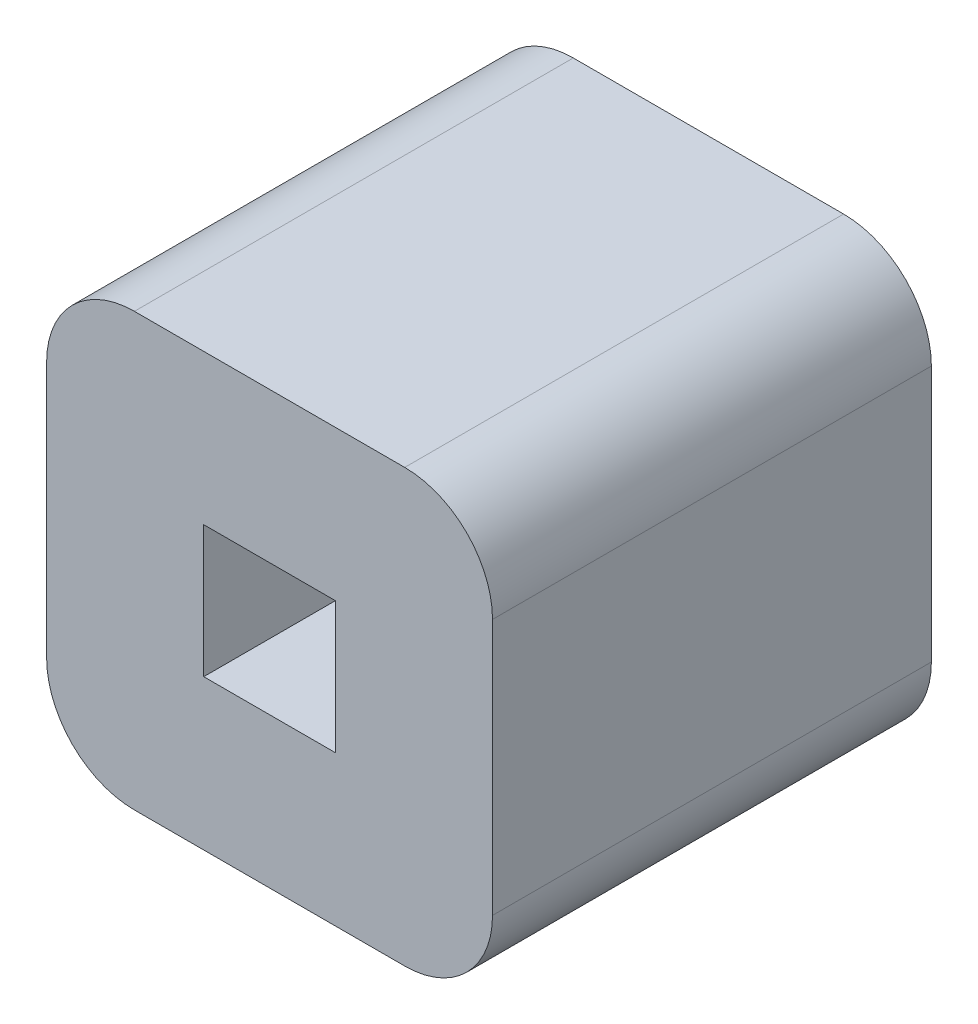
ISO-10303-21;
HEADER;
FILE_DESCRIPTION(('STEP AP214'),'2;1');
FILE_NAME('part.step','',(''),(''),'','','');
FILE_SCHEMA(('AUTOMOTIVE_DESIGN { 1 0 10303 214 1 1 1 1 }'));
ENDSEC;
DATA;
#1=APPLICATION_CONTEXT('core data for automotive mechanical design processes');
#2=APPLICATION_PROTOCOL_DEFINITION('international standard','automotive_design',2000,#1);
#3=PRODUCT_CONTEXT('',#1,'mechanical');
#4=PRODUCT('Part','Part','',(#3));
#5=PRODUCT_RELATED_PRODUCT_CATEGORY('part','',(#4));
#6=PRODUCT_DEFINITION_FORMATION('','',#4);
#7=PRODUCT_DEFINITION_CONTEXT('part definition',#1,'design');
#8=PRODUCT_DEFINITION('design','',#6,#7);
#9=PRODUCT_DEFINITION_SHAPE('','',#8);
#10=(LENGTH_UNIT() NAMED_UNIT(*) SI_UNIT(.MILLI.,.METRE.));
#11=(NAMED_UNIT(*) PLANE_ANGLE_UNIT() SI_UNIT($,.RADIAN.));
#12=(NAMED_UNIT(*) SI_UNIT($,.STERADIAN.) SOLID_ANGLE_UNIT());
#13=UNCERTAINTY_MEASURE_WITH_UNIT(LENGTH_MEASURE(1.E-05),#10,'distance_accuracy_value','');
#14=(GEOMETRIC_REPRESENTATION_CONTEXT(3) GLOBAL_UNCERTAINTY_ASSIGNED_CONTEXT((#13)) GLOBAL_UNIT_ASSIGNED_CONTEXT((#10,
#11,#12)) REPRESENTATION_CONTEXT('',''));
#15=CARTESIAN_POINT('',(0.,0.,0.));
#16=DIRECTION('',(0.,0.,1.));
#17=DIRECTION('',(1.,0.,0.));
#18=AXIS2_PLACEMENT_3D('',#15,#16,#17);
#19=CARTESIAN_POINT('',(0.860735714690616,-1.07588735959036,0.16337874015748));
#20=DIRECTION('',(0.,0.,1.));
#21=DIRECTION('',(0.,-1.,0.));
#22=AXIS2_PLACEMENT_3D('',#19,#20,#21);
#23=PLANE('',#22);
#24=DIRECTION('',(1.,0.,0.));
#25=VECTOR('',#24,1.);
#26=CARTESIAN_POINT('',(0.782389257997703,-0.966044839905316,0.16337874015748));
#27=LINE('',#26,#25);
#28=CARTESIAN_POINT('',(0.846050675320538,-0.966044839905316,0.16337874015748));
#29=VERTEX_POINT('',#28);
#30=CARTESIAN_POINT('',(0.785420754060695,-0.966044839905316,0.16337874015748));
#31=VERTEX_POINT('',#30);
#32=EDGE_CURVE('E133',#29,#31,#27,.F.);
#33=ORIENTED_EDGE('',*,*,#32,.F.);
#34=CARTESIAN_POINT('',(0.846050675320538,-0.946359800535237,0.16337874015748));
#35=DIRECTION('',(0.,0.,-1.));
#36=DIRECTION('',(0.,1.,0.));
#37=AXIS2_PLACEMENT_3D('',#34,#35,#36);
#38=CIRCLE('',#37,0.0196850393700787);
#39=CARTESIAN_POINT('',(0.865735714690616,-0.946359800535237,0.16337874015748));
#40=VERTEX_POINT('',#39);
#41=EDGE_CURVE('E160',#40,#29,#38,.T.);
#42=ORIENTED_EDGE('',*,*,#41,.F.);
#43=DIRECTION('',(0.,1.,0.));
#44=VECTOR('',#43,1.);
#45=CARTESIAN_POINT('',(0.865735714690616,-0.917619643054923,0.16337874015748));
#46=LINE('',#45,#44);
#47=CARTESIAN_POINT('',(0.865735714690616,-0.888879485574608,0.16337874015748));
#48=VERTEX_POINT('',#47);
#49=EDGE_CURVE('E130',#48,#40,#46,.F.);
#50=ORIENTED_EDGE('',*,*,#49,.F.);
#51=CARTESIAN_POINT('',(0.846050675320538,-0.888879485574608,0.16337874015748));
#52=DIRECTION('',(0.,0.,1.));
#53=DIRECTION('',(0.,-1.,0.));
#54=AXIS2_PLACEMENT_3D('',#51,#52,#53);
#55=CIRCLE('',#54,0.0196850393700787);
#56=CARTESIAN_POINT('',(0.846050675320538,-0.869194446204529,0.16337874015748));
#57=VERTEX_POINT('',#56);
#58=EDGE_CURVE('E20',#57,#48,#55,.F.);
#59=ORIENTED_EDGE('',*,*,#58,.F.);
#60=DIRECTION('',(1.,0.,0.));
#61=VECTOR('',#60,1.);
#62=CARTESIAN_POINT('',(0.782389257997703,-0.869194446204529,0.16337874015748));
#63=LINE('',#62,#61);
#64=CARTESIAN_POINT('',(0.785420754060695,-0.869194446204529,0.16337874015748));
#65=VERTEX_POINT('',#64);
#66=EDGE_CURVE('E141',#57,#65,#63,.F.);
#67=ORIENTED_EDGE('',*,*,#66,.T.);
#68=CARTESIAN_POINT('',(0.785420754060695,-0.888879485574608,0.16337874015748));
#69=DIRECTION('',(0.,0.,1.));
#70=DIRECTION('',(0.,-1.,0.));
#71=AXIS2_PLACEMENT_3D('',#68,#69,#70);
#72=CIRCLE('',#71,0.0196850393700787);
#73=CARTESIAN_POINT('',(0.765735714690617,-0.888879485574608,0.16337874015748));
#74=VERTEX_POINT('',#73);
#75=EDGE_CURVE('E143',#74,#65,#72,.F.);
#76=ORIENTED_EDGE('',*,*,#75,.F.);
#77=DIRECTION('',(0.,-1.,0.));
#78=VECTOR('',#77,1.);
#79=CARTESIAN_POINT('',(0.765735714690617,-0.781005469826576,0.16337874015748));
#80=LINE('',#79,#78);
#81=CARTESIAN_POINT('',(0.765735714690617,-0.946359800535237,0.16337874015748));
#82=VERTEX_POINT('',#81);
#83=EDGE_CURVE('E137',#82,#74,#80,.F.);
#84=ORIENTED_EDGE('',*,*,#83,.F.);
#85=CARTESIAN_POINT('',(0.785420754060695,-0.946359800535237,0.16337874015748));
#86=DIRECTION('',(0.,0.,-1.));
#87=DIRECTION('',(0.,1.,0.));
#88=AXIS2_PLACEMENT_3D('',#85,#86,#87);
#89=CIRCLE('',#88,0.0196850393700787);
#90=EDGE_CURVE('E163',#31,#82,#89,.T.);
#91=ORIENTED_EDGE('',*,*,#90,.F.);
#92=EDGE_LOOP('',(#33,#42,#50,#59,#67,#76,#84,#91));
#93=FACE_BOUND('',#92,.T.);
#94=DIRECTION('',(1.,0.,0.));
#95=VECTOR('',#94,1.);
#96=CARTESIAN_POINT('',(0.831975872170931,-0.902855863527363,0.16337874015748));
#97=LINE('',#96,#95);
#98=CARTESIAN_POINT('',(0.800971935163057,-0.902855863527363,0.16337874015748));
#99=VERTEX_POINT('',#98);
#100=CARTESIAN_POINT('',(0.830499494218176,-0.902855863527363,0.16337874015748));
#101=VERTEX_POINT('',#100);
#102=EDGE_CURVE('E107',#99,#101,#97,.T.);
#103=ORIENTED_EDGE('',*,*,#102,.T.);
#104=DIRECTION('',(0.,-1.,0.));
#105=VECTOR('',#104,1.);
#106=CARTESIAN_POINT('',(0.830499494218176,-0.901379485574608,0.16337874015748));
#107=LINE('',#106,#105);
#108=CARTESIAN_POINT('',(0.830499494218176,-0.932383422582482,0.16337874015748));
#109=VERTEX_POINT('',#108);
#110=EDGE_CURVE('E121',#109,#101,#107,.F.);
#111=ORIENTED_EDGE('',*,*,#110,.F.);
#112=DIRECTION('',(1.,0.,0.));
#113=VECTOR('',#112,1.);
#114=CARTESIAN_POINT('',(0.831975872170931,-0.932383422582482,0.16337874015748));
#115=LINE('',#114,#113);
#116=CARTESIAN_POINT('',(0.800971935163057,-0.932383422582482,0.16337874015748));
#117=VERTEX_POINT('',#116);
#118=EDGE_CURVE('E91',#117,#109,#115,.T.);
#119=ORIENTED_EDGE('',*,*,#118,.F.);
#120=DIRECTION('',(0.,1.,0.));
#121=VECTOR('',#120,1.);
#122=CARTESIAN_POINT('',(0.800971935163057,-0.933859800535237,0.16337874015748));
#123=LINE('',#122,#121);
#124=EDGE_CURVE('E105',#99,#117,#123,.F.);
#125=ORIENTED_EDGE('',*,*,#124,.F.);
#126=EDGE_LOOP('',(#103,#111,#119,#125));
#127=FACE_BOUND('',#126,.T.);
#128=ADVANCED_FACE('F17',(#93,#127),#23,.T.);
#129=CARTESIAN_POINT('',(0.800971935163057,-0.933859800535237,0.152158267716535));
#130=DIRECTION('',(1.,0.,0.));
#131=DIRECTION('',(0.,1.,0.));
#132=AXIS2_PLACEMENT_3D('',#129,#130,#131);
#133=PLANE('',#132);
#134=ORIENTED_EDGE('',*,*,#124,.T.);
#135=DIRECTION('',(0.,0.,1.));
#136=VECTOR('',#135,1.);
#137=CARTESIAN_POINT('',(0.800971935163057,-0.932383422582482,0.152158267716535));
#138=LINE('',#137,#136);
#139=CARTESIAN_POINT('',(0.800971935163057,-0.932383422582482,0.0649535433070866));
#140=VERTEX_POINT('',#139);
#141=EDGE_CURVE('E178',#140,#117,#138,.T.);
#142=ORIENTED_EDGE('',*,*,#141,.F.);
#143=DIRECTION('',(0.,-1.,0.));
#144=VECTOR('',#143,1.);
#145=CARTESIAN_POINT('',(0.800971935163057,-1.07588735959036,0.0649535433070866));
#146=LINE('',#145,#144);
#147=CARTESIAN_POINT('',(0.800971935163057,-0.902855863527363,0.0649535433070866));
#148=VERTEX_POINT('',#147);
#149=EDGE_CURVE('E126',#140,#148,#146,.F.);
#150=ORIENTED_EDGE('',*,*,#149,.T.);
#151=DIRECTION('',(0.,0.,1.));
#152=VECTOR('',#151,1.);
#153=CARTESIAN_POINT('',(0.800971935163057,-0.902855863527363,0.152158267716535));
#154=LINE('',#153,#152);
#155=EDGE_CURVE('E112',#148,#99,#154,.T.);
#156=ORIENTED_EDGE('',*,*,#155,.T.);
#157=EDGE_LOOP('',(#134,#142,#150,#156));
#158=FACE_BOUND('',#157,.T.);
#159=ADVANCED_FACE('F124',(#158),#133,.T.);
#160=CARTESIAN_POINT('',(0.831975872170931,-0.902855863527363,0.152158267716535));
#161=DIRECTION('',(0.,1.,0.));
#162=DIRECTION('',(0.,0.,1.));
#163=AXIS2_PLACEMENT_3D('',#160,#161,#162);
#164=PLANE('',#163);
#165=DIRECTION('',(0.,0.,1.));
#166=VECTOR('',#165,1.);
#167=CARTESIAN_POINT('',(0.830499494218176,-0.902855863527363,0.152158267716535));
#168=LINE('',#167,#166);
#169=CARTESIAN_POINT('',(0.830499494218176,-0.902855863527363,0.0649535433070866));
#170=VERTEX_POINT('',#169);
#171=EDGE_CURVE('E120',#101,#170,#168,.F.);
#172=ORIENTED_EDGE('',*,*,#171,.F.);
#173=ORIENTED_EDGE('',*,*,#102,.F.);
#174=ORIENTED_EDGE('',*,*,#155,.F.);
#175=DIRECTION('',(1.,0.,0.));
#176=VECTOR('',#175,1.);
#177=CARTESIAN_POINT('',(0.860735714690616,-0.902855863527363,0.0649535433070866));
#178=LINE('',#177,#176);
#179=EDGE_CURVE('E194',#148,#170,#178,.T.);
#180=ORIENTED_EDGE('',*,*,#179,.T.);
#181=EDGE_LOOP('',(#172,#173,#174,#180));
#182=FACE_BOUND('',#181,.T.);
#183=ADVANCED_FACE('F116',(#182),#164,.F.);
#184=CARTESIAN_POINT('',(0.830499494218176,-0.901379485574608,0.152158267716535));
#185=DIRECTION('',(-1.,0.,0.));
#186=DIRECTION('',(0.,-1.,0.));
#187=AXIS2_PLACEMENT_3D('',#184,#185,#186);
#188=PLANE('',#187);
#189=ORIENTED_EDGE('',*,*,#110,.T.);
#190=ORIENTED_EDGE('',*,*,#171,.T.);
#191=DIRECTION('',(0.,-1.,0.));
#192=VECTOR('',#191,1.);
#193=CARTESIAN_POINT('',(0.830499494218176,-1.07588735959036,0.0649535433070866));
#194=LINE('',#193,#192);
#195=CARTESIAN_POINT('',(0.830499494218176,-0.932383422582482,0.0649535433070866));
#196=VERTEX_POINT('',#195);
#197=EDGE_CURVE('E186',#170,#196,#194,.T.);
#198=ORIENTED_EDGE('',*,*,#197,.T.);
#199=DIRECTION('',(0.,0.,1.));
#200=VECTOR('',#199,1.);
#201=CARTESIAN_POINT('',(0.830499494218176,-0.932383422582482,0.152158267716535));
#202=LINE('',#201,#200);
#203=EDGE_CURVE('E175',#109,#196,#202,.F.);
#204=ORIENTED_EDGE('',*,*,#203,.F.);
#205=EDGE_LOOP('',(#189,#190,#198,#204));
#206=FACE_BOUND('',#205,.T.);
#207=ADVANCED_FACE('F182',(#206),#188,.T.);
#208=CARTESIAN_POINT('',(0.831975872170931,-0.932383422582482,0.152158267716535));
#209=DIRECTION('',(0.,1.,0.));
#210=DIRECTION('',(0.,0.,1.));
#211=AXIS2_PLACEMENT_3D('',#208,#209,#210);
#212=PLANE('',#211);
#213=ORIENTED_EDGE('',*,*,#118,.T.);
#214=ORIENTED_EDGE('',*,*,#203,.T.);
#215=DIRECTION('',(1.,0.,0.));
#216=VECTOR('',#215,1.);
#217=CARTESIAN_POINT('',(0.860735714690616,-0.932383422582482,0.0649535433070866));
#218=LINE('',#217,#216);
#219=EDGE_CURVE('E159',#196,#140,#218,.F.);
#220=ORIENTED_EDGE('',*,*,#219,.T.);
#221=ORIENTED_EDGE('',*,*,#141,.T.);
#222=EDGE_LOOP('',(#213,#214,#220,#221));
#223=FACE_BOUND('',#222,.T.);
#224=ADVANCED_FACE('F189',(#223),#212,.T.);
#225=CARTESIAN_POINT('',(0.846050675320538,-0.888879485574608,0.1683));
#226=DIRECTION('',(0.,0.,1.));
#227=DIRECTION('',(0.,-1.,0.));
#228=AXIS2_PLACEMENT_3D('',#225,#226,#227);
#229=CYLINDRICAL_SURFACE('',#228,0.0196850393700787);
#230=ORIENTED_EDGE('',*,*,#58,.T.);
#231=DIRECTION('',(0.,0.,1.));
#232=VECTOR('',#231,1.);
#233=CARTESIAN_POINT('',(0.865735714690616,-0.888879485574608,0.114166141732283));
#234=LINE('',#233,#232);
#235=CARTESIAN_POINT('',(0.865735714690616,-0.888879485574608,0.0649535433070866));
#236=VERTEX_POINT('',#235);
#237=EDGE_CURVE('E132',#236,#48,#234,.T.);
#238=ORIENTED_EDGE('',*,*,#237,.F.);
#239=CARTESIAN_POINT('',(0.846050675320538,-0.888879485574608,0.0649535433070866));
#240=DIRECTION('',(0.,0.,1.));
#241=DIRECTION('',(0.,-1.,0.));
#242=AXIS2_PLACEMENT_3D('',#239,#240,#241);
#243=CIRCLE('',#242,0.0196850393700787);
#244=CARTESIAN_POINT('',(0.846050675320538,-0.869194446204529,0.0649535433070866));
#245=VERTEX_POINT('',#244);
#246=EDGE_CURVE('E156',#236,#245,#243,.T.);
#247=ORIENTED_EDGE('',*,*,#246,.T.);
#248=DIRECTION('',(0.,0.,-1.));
#249=VECTOR('',#248,1.);
#250=CARTESIAN_POINT('',(0.846050675320538,-0.869194446204529,0.0600322834645669));
#251=LINE('',#250,#249);
#252=EDGE_CURVE('E144',#245,#57,#251,.F.);
#253=ORIENTED_EDGE('',*,*,#252,.T.);
#254=EDGE_LOOP('',(#230,#238,#247,#253));
#255=FACE_BOUND('',#254,.T.);
#256=ADVANCED_FACE('F232',(#255),#229,.T.);
#257=CARTESIAN_POINT('',(0.782389257997703,-0.869194446204529,0.0600322834645669));
#258=DIRECTION('',(0.,-1.,0.));
#259=DIRECTION('',(0.,0.,-1.));
#260=AXIS2_PLACEMENT_3D('',#257,#258,#259);
#261=PLANE('',#260);
#262=DIRECTION('',(0.,0.,1.));
#263=VECTOR('',#262,1.);
#264=CARTESIAN_POINT('',(0.785420754060695,-0.869194446204529,0.1683));
#265=LINE('',#264,#263);
#266=CARTESIAN_POINT('',(0.785420754060695,-0.869194446204529,0.0649535433070866));
#267=VERTEX_POINT('',#266);
#268=EDGE_CURVE('E140',#65,#267,#265,.F.);
#269=ORIENTED_EDGE('',*,*,#268,.F.);
#270=ORIENTED_EDGE('',*,*,#66,.F.);
#271=ORIENTED_EDGE('',*,*,#252,.F.);
#272=DIRECTION('',(1.,0.,0.));
#273=VECTOR('',#272,1.);
#274=CARTESIAN_POINT('',(0.860735714690616,-0.869194446204529,0.0649535433070866));
#275=LINE('',#274,#273);
#276=EDGE_CURVE('E155',#245,#267,#275,.F.);
#277=ORIENTED_EDGE('',*,*,#276,.T.);
#278=EDGE_LOOP('',(#269,#270,#271,#277));
#279=FACE_BOUND('',#278,.T.);
#280=ADVANCED_FACE('F230',(#279),#261,.F.);
#281=CARTESIAN_POINT('',(0.785420754060695,-0.888879485574608,0.1683));
#282=DIRECTION('',(0.,0.,1.));
#283=DIRECTION('',(0.,-1.,0.));
#284=AXIS2_PLACEMENT_3D('',#281,#282,#283);
#285=CYLINDRICAL_SURFACE('',#284,0.0196850393700787);
#286=ORIENTED_EDGE('',*,*,#75,.T.);
#287=ORIENTED_EDGE('',*,*,#268,.T.);
#288=CARTESIAN_POINT('',(0.785420754060695,-0.888879485574608,0.0649535433070866));
#289=DIRECTION('',(0.,0.,1.));
#290=DIRECTION('',(0.,-1.,0.));
#291=AXIS2_PLACEMENT_3D('',#288,#289,#290);
#292=CIRCLE('',#291,0.0196850393700787);
#293=CARTESIAN_POINT('',(0.765735714690617,-0.888879485574608,0.0649535433070866));
#294=VERTEX_POINT('',#293);
#295=EDGE_CURVE('E152',#267,#294,#292,.T.);
#296=ORIENTED_EDGE('',*,*,#295,.T.);
#297=DIRECTION('',(0.,0.,1.));
#298=VECTOR('',#297,1.);
#299=CARTESIAN_POINT('',(0.765735714690617,-0.888879485574608,0.0600322834645669));
#300=LINE('',#299,#298);
#301=EDGE_CURVE('E139',#74,#294,#300,.F.);
#302=ORIENTED_EDGE('',*,*,#301,.F.);
#303=EDGE_LOOP('',(#286,#287,#296,#302));
#304=FACE_BOUND('',#303,.T.);
#305=ADVANCED_FACE('F226',(#304),#285,.T.);
#306=CARTESIAN_POINT('',(0.765735714690617,-0.781005469826576,0.0600322834645669));
#307=DIRECTION('',(-1.,0.,0.));
#308=DIRECTION('',(0.,-1.,0.));
#309=AXIS2_PLACEMENT_3D('',#306,#307,#308);
#310=PLANE('',#309);
#311=DIRECTION('',(0.,-1.,0.));
#312=VECTOR('',#311,1.);
#313=CARTESIAN_POINT('',(0.765735714690617,-1.07588735959036,0.0649535433070866));
#314=LINE('',#313,#312);
#315=CARTESIAN_POINT('',(0.765735714690617,-0.946359800535237,0.0649535433070866));
#316=VERTEX_POINT('',#315);
#317=EDGE_CURVE('E151',#294,#316,#314,.T.);
#318=ORIENTED_EDGE('',*,*,#317,.T.);
#319=DIRECTION('',(0.,0.,-1.));
#320=VECTOR('',#319,1.);
#321=CARTESIAN_POINT('',(0.765735714690616,-0.946359800535237,0.1683));
#322=LINE('',#321,#320);
#323=EDGE_CURVE('E136',#82,#316,#322,.T.);
#324=ORIENTED_EDGE('',*,*,#323,.F.);
#325=ORIENTED_EDGE('',*,*,#83,.T.);
#326=ORIENTED_EDGE('',*,*,#301,.T.);
#327=EDGE_LOOP('',(#318,#324,#325,#326));
#328=FACE_BOUND('',#327,.T.);
#329=ADVANCED_FACE('F219',(#328),#310,.T.);
#330=CARTESIAN_POINT('',(0.785420754060695,-0.946359800535237,0.1683));
#331=DIRECTION('',(0.,0.,-1.));
#332=DIRECTION('',(0.,1.,0.));
#333=AXIS2_PLACEMENT_3D('',#330,#331,#332);
#334=CYLINDRICAL_SURFACE('',#333,0.0196850393700787);
#335=ORIENTED_EDGE('',*,*,#90,.T.);
#336=ORIENTED_EDGE('',*,*,#323,.T.);
#337=CARTESIAN_POINT('',(0.785420754060695,-0.946359800535237,0.0649535433070866));
#338=DIRECTION('',(0.,0.,-1.));
#339=DIRECTION('',(0.,1.,0.));
#340=AXIS2_PLACEMENT_3D('',#337,#338,#339);
#341=CIRCLE('',#340,0.0196850393700787);
#342=CARTESIAN_POINT('',(0.785420754060695,-0.966044839905316,0.0649535433070866));
#343=VERTEX_POINT('',#342);
#344=EDGE_CURVE('E148',#316,#343,#341,.F.);
#345=ORIENTED_EDGE('',*,*,#344,.T.);
#346=DIRECTION('',(0.,0.,-1.));
#347=VECTOR('',#346,1.);
#348=CARTESIAN_POINT('',(0.785420754060695,-0.966044839905316,0.0600322834645669));
#349=LINE('',#348,#347);
#350=EDGE_CURVE('E135',#31,#343,#349,.T.);
#351=ORIENTED_EDGE('',*,*,#350,.F.);
#352=EDGE_LOOP('',(#335,#336,#345,#351));
#353=FACE_BOUND('',#352,.T.);
#354=ADVANCED_FACE('F208',(#353),#334,.T.);
#355=CARTESIAN_POINT('',(0.782389257997703,-0.966044839905316,0.0600322834645669));
#356=DIRECTION('',(0.,-1.,0.));
#357=DIRECTION('',(0.,0.,-1.));
#358=AXIS2_PLACEMENT_3D('',#355,#356,#357);
#359=PLANE('',#358);
#360=ORIENTED_EDGE('',*,*,#32,.T.);
#361=ORIENTED_EDGE('',*,*,#350,.T.);
#362=DIRECTION('',(1.,0.,0.));
#363=VECTOR('',#362,1.);
#364=CARTESIAN_POINT('',(0.860735714690616,-0.966044839905316,0.0649535433070866));
#365=LINE('',#364,#363);
#366=CARTESIAN_POINT('',(0.846050675320538,-0.966044839905316,0.0649535433070866));
#367=VERTEX_POINT('',#366);
#368=EDGE_CURVE('E147',#343,#367,#365,.T.);
#369=ORIENTED_EDGE('',*,*,#368,.T.);
#370=DIRECTION('',(0.,0.,-1.));
#371=VECTOR('',#370,1.);
#372=CARTESIAN_POINT('',(0.846050675320538,-0.966044839905316,0.1683));
#373=LINE('',#372,#371);
#374=EDGE_CURVE('E162',#29,#367,#373,.T.);
#375=ORIENTED_EDGE('',*,*,#374,.F.);
#376=EDGE_LOOP('',(#360,#361,#369,#375));
#377=FACE_BOUND('',#376,.T.);
#378=ADVANCED_FACE('F223',(#377),#359,.T.);
#379=CARTESIAN_POINT('',(0.846050675320538,-0.946359800535237,0.1683));
#380=DIRECTION('',(0.,0.,-1.));
#381=DIRECTION('',(0.,1.,0.));
#382=AXIS2_PLACEMENT_3D('',#379,#380,#381);
#383=CYLINDRICAL_SURFACE('',#382,0.0196850393700787);
#384=ORIENTED_EDGE('',*,*,#41,.T.);
#385=ORIENTED_EDGE('',*,*,#374,.T.);
#386=CARTESIAN_POINT('',(0.846050675320538,-0.946359800535237,0.0649535433070866));
#387=DIRECTION('',(0.,0.,-1.));
#388=DIRECTION('',(0.,1.,0.));
#389=AXIS2_PLACEMENT_3D('',#386,#387,#388);
#390=CIRCLE('',#389,0.0196850393700787);
#391=CARTESIAN_POINT('',(0.865735714690616,-0.946359800535237,0.0649535433070866));
#392=VERTEX_POINT('',#391);
#393=EDGE_CURVE('E26',#367,#392,#390,.F.);
#394=ORIENTED_EDGE('',*,*,#393,.T.);
#395=DIRECTION('',(0.,0.,1.));
#396=VECTOR('',#395,1.);
#397=CARTESIAN_POINT('',(0.865735714690616,-0.946359800535237,0.114166141732283));
#398=LINE('',#397,#396);
#399=EDGE_CURVE('E34',#40,#392,#398,.F.);
#400=ORIENTED_EDGE('',*,*,#399,.F.);
#401=EDGE_LOOP('',(#384,#385,#394,#400));
#402=FACE_BOUND('',#401,.T.);
#403=ADVANCED_FACE('F235',(#402),#383,.T.);
#404=CARTESIAN_POINT('',(0.865735714690616,-0.917619643054923,0.114166141732283));
#405=DIRECTION('',(1.,0.,0.));
#406=DIRECTION('',(0.,1.,0.));
#407=AXIS2_PLACEMENT_3D('',#404,#405,#406);
#408=PLANE('',#407);
#409=ORIENTED_EDGE('',*,*,#49,.T.);
#410=ORIENTED_EDGE('',*,*,#399,.T.);
#411=DIRECTION('',(0.,-1.,0.));
#412=VECTOR('',#411,1.);
#413=CARTESIAN_POINT('',(0.865735714690616,-1.07588735959036,0.0649535433070866));
#414=LINE('',#413,#412);
#415=EDGE_CURVE('E11',#392,#236,#414,.F.);
#416=ORIENTED_EDGE('',*,*,#415,.T.);
#417=ORIENTED_EDGE('',*,*,#237,.T.);
#418=EDGE_LOOP('',(#409,#410,#416,#417));
#419=FACE_BOUND('',#418,.T.);
#420=ADVANCED_FACE('F236',(#419),#408,.T.);
#421=CARTESIAN_POINT('',(0.860735714690616,-1.07588735959036,0.0649535433070866));
#422=DIRECTION('',(0.,0.,1.));
#423=DIRECTION('',(0.,-1.,0.));
#424=AXIS2_PLACEMENT_3D('',#421,#422,#423);
#425=PLANE('',#424);
#426=ORIENTED_EDGE('',*,*,#393,.F.);
#427=ORIENTED_EDGE('',*,*,#368,.F.);
#428=ORIENTED_EDGE('',*,*,#344,.F.);
#429=ORIENTED_EDGE('',*,*,#317,.F.);
#430=ORIENTED_EDGE('',*,*,#295,.F.);
#431=ORIENTED_EDGE('',*,*,#276,.F.);
#432=ORIENTED_EDGE('',*,*,#246,.F.);
#433=ORIENTED_EDGE('',*,*,#415,.F.);
#434=EDGE_LOOP('',(#426,#427,#428,#429,#430,#431,#432,#433));
#435=FACE_BOUND('',#434,.T.);
#436=ORIENTED_EDGE('',*,*,#197,.F.);
#437=ORIENTED_EDGE('',*,*,#179,.F.);
#438=ORIENTED_EDGE('',*,*,#149,.F.);
#439=ORIENTED_EDGE('',*,*,#219,.F.);
#440=EDGE_LOOP('',(#436,#437,#438,#439));
#441=FACE_BOUND('',#440,.T.);
#442=ADVANCED_FACE('F192',(#435,#441),#425,.F.);
#443=CLOSED_SHELL('',(#128,#159,#183,#207,#224,#256,#280,#305,#329,#354,#378,#403,#420,#442));
#444=MANIFOLD_SOLID_BREP('B1',#443);
#445=ADVANCED_BREP_SHAPE_REPRESENTATION('',(#18,#444),#14);
#446=SHAPE_DEFINITION_REPRESENTATION(#9,#445);
ENDSEC;
END-ISO-10303-21;
